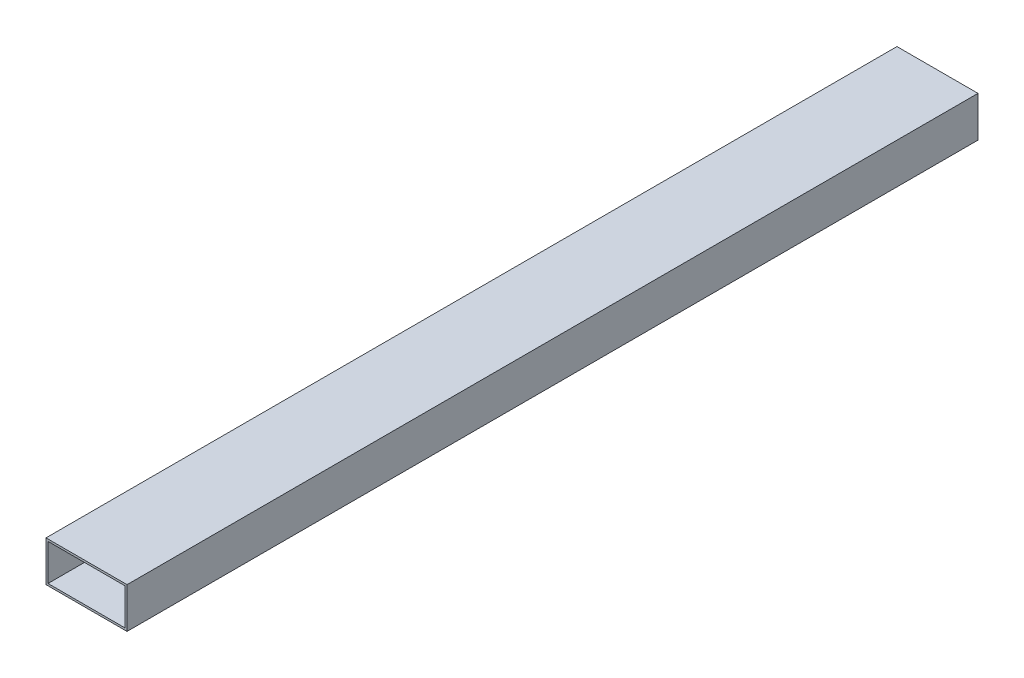
ISO-10303-21;
HEADER;
FILE_DESCRIPTION(('STEP AP214'),'2;1');
FILE_NAME('part.step','',(''),(''),'','','');
FILE_SCHEMA(('AUTOMOTIVE_DESIGN { 1 0 10303 214 1 1 1 1 }'));
ENDSEC;
DATA;
#1=APPLICATION_CONTEXT('core data for automotive mechanical design processes');
#2=APPLICATION_PROTOCOL_DEFINITION('international standard','automotive_design',2000,#1);
#3=PRODUCT_CONTEXT('',#1,'mechanical');
#4=PRODUCT('Part','Part','',(#3));
#5=PRODUCT_RELATED_PRODUCT_CATEGORY('part','',(#4));
#6=PRODUCT_DEFINITION_FORMATION('','',#4);
#7=PRODUCT_DEFINITION_CONTEXT('part definition',#1,'design');
#8=PRODUCT_DEFINITION('design','',#6,#7);
#9=PRODUCT_DEFINITION_SHAPE('','',#8);
#10=(LENGTH_UNIT() NAMED_UNIT(*) SI_UNIT(.MILLI.,.METRE.));
#11=(NAMED_UNIT(*) PLANE_ANGLE_UNIT() SI_UNIT($,.RADIAN.));
#12=(NAMED_UNIT(*) SI_UNIT($,.STERADIAN.) SOLID_ANGLE_UNIT());
#13=UNCERTAINTY_MEASURE_WITH_UNIT(LENGTH_MEASURE(1.E-05),#10,'distance_accuracy_value','');
#14=(GEOMETRIC_REPRESENTATION_CONTEXT(3) GLOBAL_UNCERTAINTY_ASSIGNED_CONTEXT((#13)) GLOBAL_UNIT_ASSIGNED_CONTEXT((#10,
#11,#12)) REPRESENTATION_CONTEXT('',''));
#15=CARTESIAN_POINT('',(0.,0.,0.));
#16=DIRECTION('',(0.,0.,1.));
#17=DIRECTION('',(1.,0.,0.));
#18=AXIS2_PLACEMENT_3D('',#15,#16,#17);
#19=CARTESIAN_POINT('',(-20.,-10.,420.));
#20=DIRECTION('',(1.,0.,0.));
#21=DIRECTION('',(0.,0.,-1.));
#22=AXIS2_PLACEMENT_3D('',#19,#20,#21);
#23=PLANE('',#22);
#24=DIRECTION('',(0.,-1.,0.));
#25=VECTOR('',#24,1.);
#26=CARTESIAN_POINT('',(-20.,-10.,0.));
#27=LINE('',#26,#25);
#28=CARTESIAN_POINT('',(-20.,10.,0.));
#29=VERTEX_POINT('',#28);
#30=CARTESIAN_POINT('',(-20.,-10.,0.));
#31=VERTEX_POINT('',#30);
#32=EDGE_CURVE('E134',#29,#31,#27,.T.);
#33=ORIENTED_EDGE('',*,*,#32,.T.);
#34=DIRECTION('',(0.,0.,-1.));
#35=VECTOR('',#34,1.);
#36=CARTESIAN_POINT('',(-20.,-10.,420.));
#37=LINE('',#36,#35);
#38=CARTESIAN_POINT('',(-20.,-10.,420.));
#39=VERTEX_POINT('',#38);
#40=EDGE_CURVE('E11',#39,#31,#37,.T.);
#41=ORIENTED_EDGE('',*,*,#40,.F.);
#42=DIRECTION('',(0.,-1.,0.));
#43=VECTOR('',#42,1.);
#44=CARTESIAN_POINT('',(-20.,-10.,420.));
#45=LINE('',#44,#43);
#46=CARTESIAN_POINT('',(-20.,10.,420.));
#47=VERTEX_POINT('',#46);
#48=EDGE_CURVE('E138',#47,#39,#45,.T.);
#49=ORIENTED_EDGE('',*,*,#48,.F.);
#50=DIRECTION('',(0.,0.,-1.));
#51=VECTOR('',#50,1.);
#52=CARTESIAN_POINT('',(-20.,10.,420.));
#53=LINE('',#52,#51);
#54=EDGE_CURVE('E148',#47,#29,#53,.T.);
#55=ORIENTED_EDGE('',*,*,#54,.T.);
#56=EDGE_LOOP('',(#33,#41,#49,#55));
#57=FACE_BOUND('',#56,.T.);
#58=ADVANCED_FACE('F37',(#57),#23,.F.);
#59=CARTESIAN_POINT('',(20.,-10.,420.));
#60=DIRECTION('',(0.,1.,0.));
#61=DIRECTION('',(0.,0.,1.));
#62=AXIS2_PLACEMENT_3D('',#59,#60,#61);
#63=PLANE('',#62);
#64=DIRECTION('',(1.,0.,0.));
#65=VECTOR('',#64,1.);
#66=CARTESIAN_POINT('',(20.,-10.,0.));
#67=LINE('',#66,#65);
#68=CARTESIAN_POINT('',(20.,-10.,0.));
#69=VERTEX_POINT('',#68);
#70=EDGE_CURVE('E151',#31,#69,#67,.T.);
#71=ORIENTED_EDGE('',*,*,#70,.T.);
#72=DIRECTION('',(0.,0.,-1.));
#73=VECTOR('',#72,1.);
#74=CARTESIAN_POINT('',(20.,-10.,420.));
#75=LINE('',#74,#73);
#76=CARTESIAN_POINT('',(20.,-10.,420.));
#77=VERTEX_POINT('',#76);
#78=EDGE_CURVE('E44',#77,#69,#75,.T.);
#79=ORIENTED_EDGE('',*,*,#78,.F.);
#80=DIRECTION('',(1.,0.,0.));
#81=VECTOR('',#80,1.);
#82=CARTESIAN_POINT('',(20.,-10.,420.));
#83=LINE('',#82,#81);
#84=EDGE_CURVE('E141',#39,#77,#83,.T.);
#85=ORIENTED_EDGE('',*,*,#84,.F.);
#86=ORIENTED_EDGE('',*,*,#40,.T.);
#87=EDGE_LOOP('',(#71,#79,#85,#86));
#88=FACE_BOUND('',#87,.T.);
#89=ADVANCED_FACE('F179',(#88),#63,.F.);
#90=CARTESIAN_POINT('',(20.,10.,420.));
#91=DIRECTION('',(-1.,0.,0.));
#92=DIRECTION('',(0.,0.,1.));
#93=AXIS2_PLACEMENT_3D('',#90,#91,#92);
#94=PLANE('',#93);
#95=DIRECTION('',(0.,1.,0.));
#96=VECTOR('',#95,1.);
#97=CARTESIAN_POINT('',(20.,10.,0.));
#98=LINE('',#97,#96);
#99=CARTESIAN_POINT('',(20.,10.,0.));
#100=VERTEX_POINT('',#99);
#101=EDGE_CURVE('E153',#69,#100,#98,.T.);
#102=ORIENTED_EDGE('',*,*,#101,.T.);
#103=DIRECTION('',(0.,0.,-1.));
#104=VECTOR('',#103,1.);
#105=CARTESIAN_POINT('',(20.,10.,420.));
#106=LINE('',#105,#104);
#107=CARTESIAN_POINT('',(20.,10.,420.));
#108=VERTEX_POINT('',#107);
#109=EDGE_CURVE('E158',#108,#100,#106,.T.);
#110=ORIENTED_EDGE('',*,*,#109,.F.);
#111=DIRECTION('',(0.,1.,0.));
#112=VECTOR('',#111,1.);
#113=CARTESIAN_POINT('',(20.,10.,420.));
#114=LINE('',#113,#112);
#115=EDGE_CURVE('E144',#77,#108,#114,.T.);
#116=ORIENTED_EDGE('',*,*,#115,.F.);
#117=ORIENTED_EDGE('',*,*,#78,.T.);
#118=EDGE_LOOP('',(#102,#110,#116,#117));
#119=FACE_BOUND('',#118,.T.);
#120=ADVANCED_FACE('F165',(#119),#94,.F.);
#121=CARTESIAN_POINT('',(-20.,10.,420.));
#122=DIRECTION('',(0.,-1.,0.));
#123=DIRECTION('',(0.,0.,-1.));
#124=AXIS2_PLACEMENT_3D('',#121,#122,#123);
#125=PLANE('',#124);
#126=DIRECTION('',(-1.,0.,0.));
#127=VECTOR('',#126,1.);
#128=CARTESIAN_POINT('',(-20.,10.,0.));
#129=LINE('',#128,#127);
#130=EDGE_CURVE('E142',#100,#29,#129,.T.);
#131=ORIENTED_EDGE('',*,*,#130,.T.);
#132=ORIENTED_EDGE('',*,*,#54,.F.);
#133=DIRECTION('',(-1.,0.,0.));
#134=VECTOR('',#133,1.);
#135=CARTESIAN_POINT('',(-20.,10.,420.));
#136=LINE('',#135,#134);
#137=EDGE_CURVE('E146',#108,#47,#136,.T.);
#138=ORIENTED_EDGE('',*,*,#137,.F.);
#139=ORIENTED_EDGE('',*,*,#109,.T.);
#140=EDGE_LOOP('',(#131,#132,#138,#139));
#141=FACE_BOUND('',#140,.T.);
#142=ADVANCED_FACE('F172',(#141),#125,.F.);
#143=CARTESIAN_POINT('',(0.,0.,420.));
#144=DIRECTION('',(0.,0.,-1.));
#145=DIRECTION('',(-1.,0.,0.));
#146=AXIS2_PLACEMENT_3D('',#143,#144,#145);
#147=PLANE('',#146);
#148=DIRECTION('',(0.,-1.,0.));
#149=VECTOR('',#148,1.);
#150=CARTESIAN_POINT('',(-19.,9.,420.));
#151=LINE('',#150,#149);
#152=CARTESIAN_POINT('',(-19.,9.,420.));
#153=VERTEX_POINT('',#152);
#154=CARTESIAN_POINT('',(-19.,-9.,420.));
#155=VERTEX_POINT('',#154);
#156=EDGE_CURVE('E128',#153,#155,#151,.T.);
#157=ORIENTED_EDGE('',*,*,#156,.F.);
#158=DIRECTION('',(-1.,0.,0.));
#159=VECTOR('',#158,1.);
#160=CARTESIAN_POINT('',(19.,9.,420.));
#161=LINE('',#160,#159);
#162=CARTESIAN_POINT('',(19.,9.,420.));
#163=VERTEX_POINT('',#162);
#164=EDGE_CURVE('E51',#163,#153,#161,.T.);
#165=ORIENTED_EDGE('',*,*,#164,.F.);
#166=DIRECTION('',(0.,1.,0.));
#167=VECTOR('',#166,1.);
#168=CARTESIAN_POINT('',(19.,-9.,420.));
#169=LINE('',#168,#167);
#170=CARTESIAN_POINT('',(19.,-9.,420.));
#171=VERTEX_POINT('',#170);
#172=EDGE_CURVE('E119',#171,#163,#169,.T.);
#173=ORIENTED_EDGE('',*,*,#172,.F.);
#174=DIRECTION('',(1.,0.,0.));
#175=VECTOR('',#174,1.);
#176=CARTESIAN_POINT('',(-19.,-9.,420.));
#177=LINE('',#176,#175);
#178=EDGE_CURVE('E122',#155,#171,#177,.T.);
#179=ORIENTED_EDGE('',*,*,#178,.F.);
#180=EDGE_LOOP('',(#157,#165,#173,#179));
#181=FACE_BOUND('',#180,.T.);
#182=ORIENTED_EDGE('',*,*,#48,.T.);
#183=ORIENTED_EDGE('',*,*,#84,.T.);
#184=ORIENTED_EDGE('',*,*,#115,.T.);
#185=ORIENTED_EDGE('',*,*,#137,.T.);
#186=EDGE_LOOP('',(#182,#183,#184,#185));
#187=FACE_BOUND('',#186,.T.);
#188=ADVANCED_FACE('F178',(#181,#187),#147,.F.);
#189=CARTESIAN_POINT('',(0.,0.,0.));
#190=DIRECTION('',(0.,0.,-1.));
#191=DIRECTION('',(-1.,0.,0.));
#192=AXIS2_PLACEMENT_3D('',#189,#190,#191);
#193=PLANE('',#192);
#194=DIRECTION('',(-1.,0.,0.));
#195=VECTOR('',#194,1.);
#196=CARTESIAN_POINT('',(19.,9.,0.));
#197=LINE('',#196,#195);
#198=CARTESIAN_POINT('',(19.,9.,0.));
#199=VERTEX_POINT('',#198);
#200=CARTESIAN_POINT('',(-19.,9.,0.));
#201=VERTEX_POINT('',#200);
#202=EDGE_CURVE('E103',#199,#201,#197,.T.);
#203=ORIENTED_EDGE('',*,*,#202,.T.);
#204=DIRECTION('',(0.,-1.,0.));
#205=VECTOR('',#204,1.);
#206=CARTESIAN_POINT('',(-19.,9.,0.));
#207=LINE('',#206,#205);
#208=CARTESIAN_POINT('',(-19.,-9.,0.));
#209=VERTEX_POINT('',#208);
#210=EDGE_CURVE('E112',#201,#209,#207,.T.);
#211=ORIENTED_EDGE('',*,*,#210,.T.);
#212=DIRECTION('',(1.,0.,0.));
#213=VECTOR('',#212,1.);
#214=CARTESIAN_POINT('',(-19.,-9.,0.));
#215=LINE('',#214,#213);
#216=CARTESIAN_POINT('',(19.,-9.,0.));
#217=VERTEX_POINT('',#216);
#218=EDGE_CURVE('E59',#209,#217,#215,.T.);
#219=ORIENTED_EDGE('',*,*,#218,.T.);
#220=DIRECTION('',(0.,1.,0.));
#221=VECTOR('',#220,1.);
#222=CARTESIAN_POINT('',(19.,-9.,0.));
#223=LINE('',#222,#221);
#224=EDGE_CURVE('E109',#217,#199,#223,.T.);
#225=ORIENTED_EDGE('',*,*,#224,.T.);
#226=EDGE_LOOP('',(#203,#211,#219,#225));
#227=FACE_BOUND('',#226,.T.);
#228=ORIENTED_EDGE('',*,*,#32,.F.);
#229=ORIENTED_EDGE('',*,*,#130,.F.);
#230=ORIENTED_EDGE('',*,*,#101,.F.);
#231=ORIENTED_EDGE('',*,*,#70,.F.);
#232=EDGE_LOOP('',(#228,#229,#230,#231));
#233=FACE_BOUND('',#232,.T.);
#234=ADVANCED_FACE('F116',(#227,#233),#193,.T.);
#235=CARTESIAN_POINT('',(19.,9.,0.));
#236=DIRECTION('',(0.,1.,0.));
#237=DIRECTION('',(0.,0.,1.));
#238=AXIS2_PLACEMENT_3D('',#235,#236,#237);
#239=PLANE('',#238);
#240=ORIENTED_EDGE('',*,*,#164,.T.);
#241=DIRECTION('',(0.,0.,1.));
#242=VECTOR('',#241,1.);
#243=CARTESIAN_POINT('',(-19.,9.,0.));
#244=LINE('',#243,#242);
#245=EDGE_CURVE('E99',#201,#153,#244,.T.);
#246=ORIENTED_EDGE('',*,*,#245,.F.);
#247=ORIENTED_EDGE('',*,*,#202,.F.);
#248=DIRECTION('',(0.,0.,1.));
#249=VECTOR('',#248,1.);
#250=CARTESIAN_POINT('',(19.,9.,0.));
#251=LINE('',#250,#249);
#252=EDGE_CURVE('E132',#199,#163,#251,.T.);
#253=ORIENTED_EDGE('',*,*,#252,.T.);
#254=EDGE_LOOP('',(#240,#246,#247,#253));
#255=FACE_BOUND('',#254,.T.);
#256=ADVANCED_FACE('F101',(#255),#239,.F.);
#257=CARTESIAN_POINT('',(19.,-9.,0.));
#258=DIRECTION('',(1.,0.,0.));
#259=DIRECTION('',(0.,0.,-1.));
#260=AXIS2_PLACEMENT_3D('',#257,#258,#259);
#261=PLANE('',#260);
#262=ORIENTED_EDGE('',*,*,#172,.T.);
#263=ORIENTED_EDGE('',*,*,#252,.F.);
#264=ORIENTED_EDGE('',*,*,#224,.F.);
#265=DIRECTION('',(0.,0.,1.));
#266=VECTOR('',#265,1.);
#267=CARTESIAN_POINT('',(19.,-9.,0.));
#268=LINE('',#267,#266);
#269=EDGE_CURVE('E135',#217,#171,#268,.T.);
#270=ORIENTED_EDGE('',*,*,#269,.T.);
#271=EDGE_LOOP('',(#262,#263,#264,#270));
#272=FACE_BOUND('',#271,.T.);
#273=ADVANCED_FACE('F196',(#272),#261,.F.);
#274=CARTESIAN_POINT('',(-19.,-9.,0.));
#275=DIRECTION('',(0.,-1.,0.));
#276=DIRECTION('',(0.,0.,-1.));
#277=AXIS2_PLACEMENT_3D('',#274,#275,#276);
#278=PLANE('',#277);
#279=ORIENTED_EDGE('',*,*,#178,.T.);
#280=ORIENTED_EDGE('',*,*,#269,.F.);
#281=ORIENTED_EDGE('',*,*,#218,.F.);
#282=DIRECTION('',(0.,0.,1.));
#283=VECTOR('',#282,1.);
#284=CARTESIAN_POINT('',(-19.,-9.,0.));
#285=LINE('',#284,#283);
#286=EDGE_CURVE('E108',#209,#155,#285,.T.);
#287=ORIENTED_EDGE('',*,*,#286,.T.);
#288=EDGE_LOOP('',(#279,#280,#281,#287));
#289=FACE_BOUND('',#288,.T.);
#290=ADVANCED_FACE('F199',(#289),#278,.F.);
#291=CARTESIAN_POINT('',(-19.,9.,0.));
#292=DIRECTION('',(-1.,0.,0.));
#293=DIRECTION('',(0.,0.,1.));
#294=AXIS2_PLACEMENT_3D('',#291,#292,#293);
#295=PLANE('',#294);
#296=ORIENTED_EDGE('',*,*,#156,.T.);
#297=ORIENTED_EDGE('',*,*,#286,.F.);
#298=ORIENTED_EDGE('',*,*,#210,.F.);
#299=ORIENTED_EDGE('',*,*,#245,.T.);
#300=EDGE_LOOP('',(#296,#297,#298,#299));
#301=FACE_BOUND('',#300,.T.);
#302=ADVANCED_FACE('F113',(#301),#295,.F.);
#303=CLOSED_SHELL('',(#58,#89,#120,#142,#188,#234,#256,#273,#290,#302));
#304=MANIFOLD_SOLID_BREP('B2',#303);
#305=ADVANCED_BREP_SHAPE_REPRESENTATION('',(#18,#304),#14);
#306=SHAPE_DEFINITION_REPRESENTATION(#9,#305);
ENDSEC;
END-ISO-10303-21;
